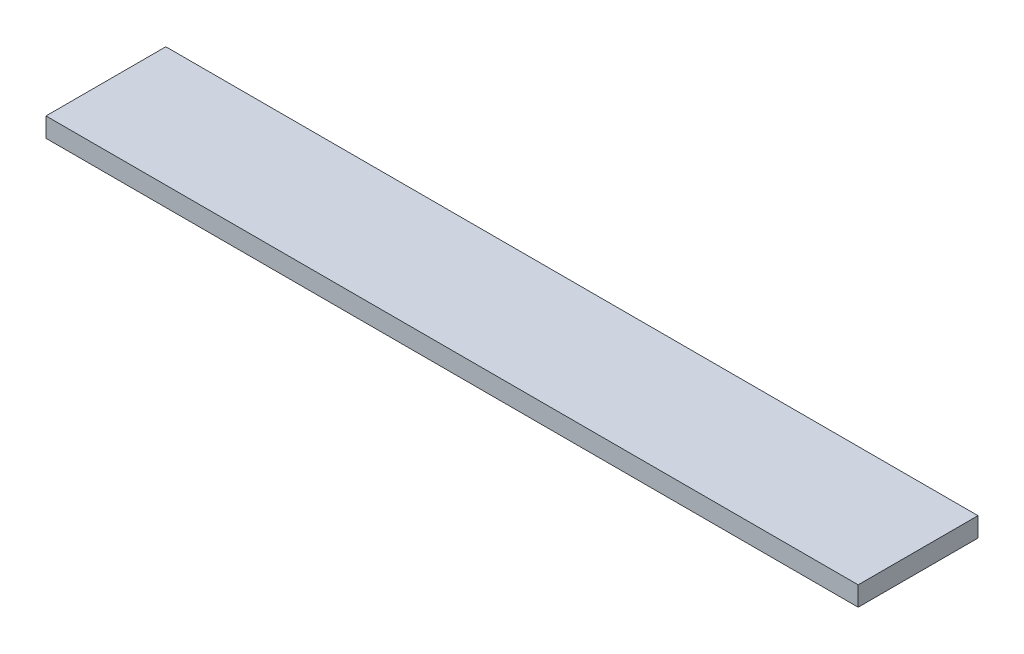
ISO-10303-21;
HEADER;
FILE_DESCRIPTION(('STEP AP214'),'2;1');
FILE_NAME('part.step','',(''),(''),'','','');
FILE_SCHEMA(('AUTOMOTIVE_DESIGN { 1 0 10303 214 1 1 1 1 }'));
ENDSEC;
DATA;
#1=APPLICATION_CONTEXT('core data for automotive mechanical design processes');
#2=APPLICATION_PROTOCOL_DEFINITION('international standard','automotive_design',2000,#1);
#3=PRODUCT_CONTEXT('',#1,'mechanical');
#4=PRODUCT('Part','Part','',(#3));
#5=PRODUCT_RELATED_PRODUCT_CATEGORY('part','',(#4));
#6=PRODUCT_DEFINITION_FORMATION('','',#4);
#7=PRODUCT_DEFINITION_CONTEXT('part definition',#1,'design');
#8=PRODUCT_DEFINITION('design','',#6,#7);
#9=PRODUCT_DEFINITION_SHAPE('','',#8);
#10=(LENGTH_UNIT() NAMED_UNIT(*) SI_UNIT(.MILLI.,.METRE.));
#11=(NAMED_UNIT(*) PLANE_ANGLE_UNIT() SI_UNIT($,.RADIAN.));
#12=(NAMED_UNIT(*) SI_UNIT($,.STERADIAN.) SOLID_ANGLE_UNIT());
#13=UNCERTAINTY_MEASURE_WITH_UNIT(LENGTH_MEASURE(1.E-05),#10,'distance_accuracy_value','');
#14=(GEOMETRIC_REPRESENTATION_CONTEXT(3) GLOBAL_UNCERTAINTY_ASSIGNED_CONTEXT((#13)) GLOBAL_UNIT_ASSIGNED_CONTEXT((#10,
#11,#12)) REPRESENTATION_CONTEXT('',''));
#15=CARTESIAN_POINT('',(0.,0.,0.));
#16=DIRECTION('',(0.,0.,1.));
#17=DIRECTION('',(1.,0.,0.));
#18=AXIS2_PLACEMENT_3D('',#15,#16,#17);
#19=CARTESIAN_POINT('',(30.5,1.46,-4.5));
#20=DIRECTION('',(-1.,0.,0.));
#21=DIRECTION('',(0.,0.,1.));
#22=AXIS2_PLACEMENT_3D('',#19,#20,#21);
#23=PLANE('',#22);
#24=DIRECTION('',(0.,0.,-1.));
#25=VECTOR('',#24,1.);
#26=CARTESIAN_POINT('',(30.5,0.,-4.5));
#27=LINE('',#26,#25);
#28=CARTESIAN_POINT('',(30.5,0.,4.5));
#29=VERTEX_POINT('',#28);
#30=CARTESIAN_POINT('',(30.5,0.,-4.5));
#31=VERTEX_POINT('',#30);
#32=EDGE_CURVE('E95',#29,#31,#27,.T.);
#33=ORIENTED_EDGE('',*,*,#32,.T.);
#34=DIRECTION('',(0.,-1.,0.));
#35=VECTOR('',#34,1.);
#36=CARTESIAN_POINT('',(30.5,1.46,-4.5));
#37=LINE('',#36,#35);
#38=CARTESIAN_POINT('',(30.5,1.46,-4.5));
#39=VERTEX_POINT('',#38);
#40=EDGE_CURVE('E11',#39,#31,#37,.T.);
#41=ORIENTED_EDGE('',*,*,#40,.F.);
#42=DIRECTION('',(0.,0.,-1.));
#43=VECTOR('',#42,1.);
#44=CARTESIAN_POINT('',(30.5,1.46,-4.5));
#45=LINE('',#44,#43);
#46=CARTESIAN_POINT('',(30.5,1.46,4.5));
#47=VERTEX_POINT('',#46);
#48=EDGE_CURVE('E83',#47,#39,#45,.T.);
#49=ORIENTED_EDGE('',*,*,#48,.F.);
#50=DIRECTION('',(0.,-1.,0.));
#51=VECTOR('',#50,1.);
#52=CARTESIAN_POINT('',(30.5,1.46,4.5));
#53=LINE('',#52,#51);
#54=EDGE_CURVE('E91',#47,#29,#53,.T.);
#55=ORIENTED_EDGE('',*,*,#54,.T.);
#56=EDGE_LOOP('',(#33,#41,#49,#55));
#57=FACE_BOUND('',#56,.T.);
#58=ADVANCED_FACE('F32',(#57),#23,.F.);
#59=CARTESIAN_POINT('',(-30.5,1.46,-4.5));
#60=DIRECTION('',(0.,0.,1.));
#61=DIRECTION('',(1.,0.,0.));
#62=AXIS2_PLACEMENT_3D('',#59,#60,#61);
#63=PLANE('',#62);
#64=DIRECTION('',(-1.,0.,0.));
#65=VECTOR('',#64,1.);
#66=CARTESIAN_POINT('',(-30.5,0.,-4.5));
#67=LINE('',#66,#65);
#68=CARTESIAN_POINT('',(-30.5,0.,-4.5));
#69=VERTEX_POINT('',#68);
#70=EDGE_CURVE('E87',#31,#69,#67,.T.);
#71=ORIENTED_EDGE('',*,*,#70,.T.);
#72=DIRECTION('',(0.,-1.,0.));
#73=VECTOR('',#72,1.);
#74=CARTESIAN_POINT('',(-30.5,1.46,-4.5));
#75=LINE('',#74,#73);
#76=CARTESIAN_POINT('',(-30.5,1.46,-4.5));
#77=VERTEX_POINT('',#76);
#78=EDGE_CURVE('E40',#77,#69,#75,.T.);
#79=ORIENTED_EDGE('',*,*,#78,.F.);
#80=DIRECTION('',(-1.,0.,0.));
#81=VECTOR('',#80,1.);
#82=CARTESIAN_POINT('',(-30.5,1.46,-4.5));
#83=LINE('',#82,#81);
#84=EDGE_CURVE('E78',#39,#77,#83,.T.);
#85=ORIENTED_EDGE('',*,*,#84,.F.);
#86=ORIENTED_EDGE('',*,*,#40,.T.);
#87=EDGE_LOOP('',(#71,#79,#85,#86));
#88=FACE_BOUND('',#87,.T.);
#89=ADVANCED_FACE('F86',(#88),#63,.F.);
#90=CARTESIAN_POINT('',(-30.5,1.46,-4.5));
#91=DIRECTION('',(1.,0.,0.));
#92=DIRECTION('',(0.,0.,-1.));
#93=AXIS2_PLACEMENT_3D('',#90,#91,#92);
#94=PLANE('',#93);
#95=DIRECTION('',(0.,0.,1.));
#96=VECTOR('',#95,1.);
#97=CARTESIAN_POINT('',(-30.5,0.,-4.5));
#98=LINE('',#97,#96);
#99=CARTESIAN_POINT('',(-30.5,0.,4.5));
#100=VERTEX_POINT('',#99);
#101=EDGE_CURVE('E65',#69,#100,#98,.T.);
#102=ORIENTED_EDGE('',*,*,#101,.T.);
#103=DIRECTION('',(0.,-1.,0.));
#104=VECTOR('',#103,1.);
#105=CARTESIAN_POINT('',(-30.5,1.46,4.5));
#106=LINE('',#105,#104);
#107=CARTESIAN_POINT('',(-30.5,1.46,4.5));
#108=VERTEX_POINT('',#107);
#109=EDGE_CURVE('E88',#108,#100,#106,.T.);
#110=ORIENTED_EDGE('',*,*,#109,.F.);
#111=DIRECTION('',(0.,0.,1.));
#112=VECTOR('',#111,1.);
#113=CARTESIAN_POINT('',(-30.5,1.46,-4.5));
#114=LINE('',#113,#112);
#115=EDGE_CURVE('E81',#77,#108,#114,.T.);
#116=ORIENTED_EDGE('',*,*,#115,.F.);
#117=ORIENTED_EDGE('',*,*,#78,.T.);
#118=EDGE_LOOP('',(#102,#110,#116,#117));
#119=FACE_BOUND('',#118,.T.);
#120=ADVANCED_FACE('F89',(#119),#94,.F.);
#121=CARTESIAN_POINT('',(-30.5,1.46,4.5));
#122=DIRECTION('',(0.,0.,-1.));
#123=DIRECTION('',(-1.,0.,0.));
#124=AXIS2_PLACEMENT_3D('',#121,#122,#123);
#125=PLANE('',#124);
#126=DIRECTION('',(1.,0.,0.));
#127=VECTOR('',#126,1.);
#128=CARTESIAN_POINT('',(-30.5,0.,4.5));
#129=LINE('',#128,#127);
#130=EDGE_CURVE('E71',#100,#29,#129,.T.);
#131=ORIENTED_EDGE('',*,*,#130,.T.);
#132=ORIENTED_EDGE('',*,*,#54,.F.);
#133=DIRECTION('',(1.,0.,0.));
#134=VECTOR('',#133,1.);
#135=CARTESIAN_POINT('',(-30.5,1.46,4.5));
#136=LINE('',#135,#134);
#137=EDGE_CURVE('E48',#108,#47,#136,.T.);
#138=ORIENTED_EDGE('',*,*,#137,.F.);
#139=ORIENTED_EDGE('',*,*,#109,.T.);
#140=EDGE_LOOP('',(#131,#132,#138,#139));
#141=FACE_BOUND('',#140,.T.);
#142=ADVANCED_FACE('F102',(#141),#125,.F.);
#143=CARTESIAN_POINT('',(0.,1.46,0.));
#144=DIRECTION('',(0.,1.,0.));
#145=DIRECTION('',(0.,0.,1.));
#146=AXIS2_PLACEMENT_3D('',#143,#144,#145);
#147=PLANE('',#146);
#148=ORIENTED_EDGE('',*,*,#48,.T.);
#149=ORIENTED_EDGE('',*,*,#84,.T.);
#150=ORIENTED_EDGE('',*,*,#115,.T.);
#151=ORIENTED_EDGE('',*,*,#137,.T.);
#152=EDGE_LOOP('',(#148,#149,#150,#151));
#153=FACE_BOUND('',#152,.T.);
#154=ADVANCED_FACE('F79',(#153),#147,.T.);
#155=CARTESIAN_POINT('',(0.,0.,0.));
#156=DIRECTION('',(0.,1.,0.));
#157=DIRECTION('',(0.,0.,1.));
#158=AXIS2_PLACEMENT_3D('',#155,#156,#157);
#159=PLANE('',#158);
#160=ORIENTED_EDGE('',*,*,#32,.F.);
#161=ORIENTED_EDGE('',*,*,#130,.F.);
#162=ORIENTED_EDGE('',*,*,#101,.F.);
#163=ORIENTED_EDGE('',*,*,#70,.F.);
#164=EDGE_LOOP('',(#160,#161,#162,#163));
#165=FACE_BOUND('',#164,.T.);
#166=ADVANCED_FACE('F105',(#165),#159,.F.);
#167=CLOSED_SHELL('',(#58,#89,#120,#142,#154,#166));
#168=MANIFOLD_SOLID_BREP('B2',#167);
#169=ADVANCED_BREP_SHAPE_REPRESENTATION('',(#18,#168),#14);
#170=SHAPE_DEFINITION_REPRESENTATION(#9,#169);
ENDSEC;
END-ISO-10303-21;
